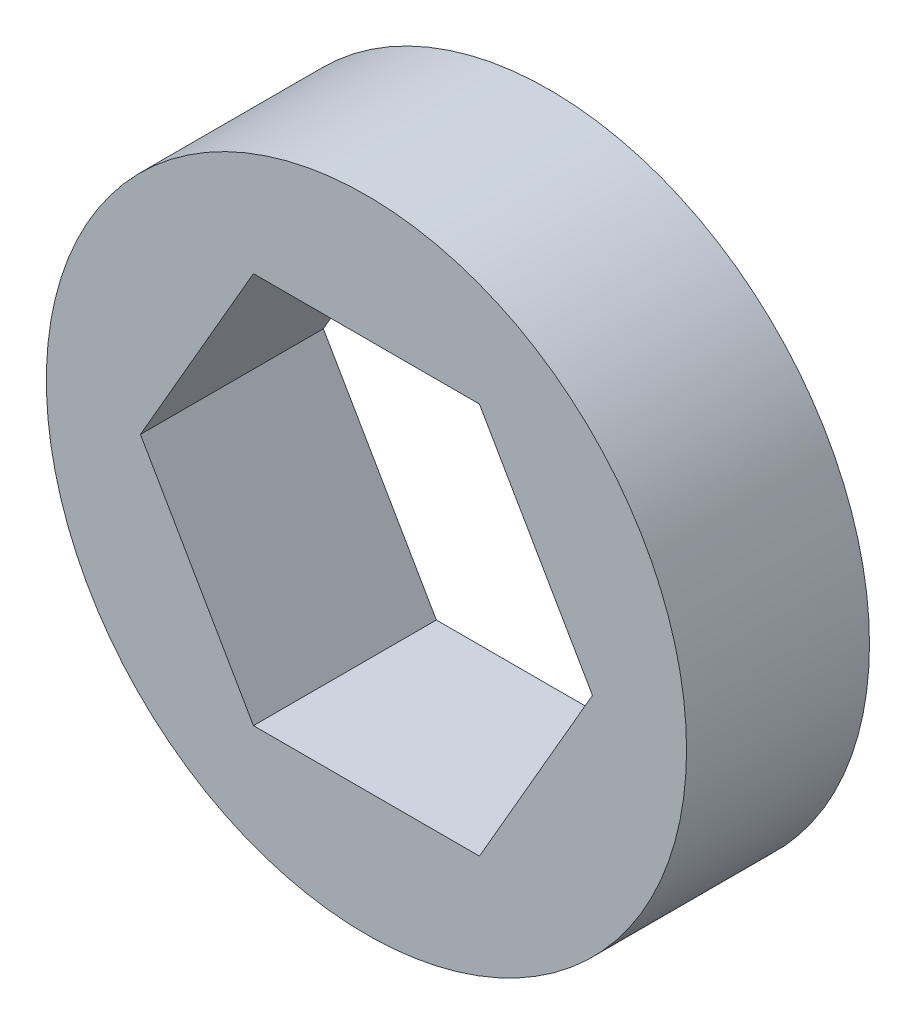
ISO-10303-21;
HEADER;
FILE_DESCRIPTION(('STEP AP214'),'2;1');
FILE_NAME('part.step','',(''),(''),'','','');
FILE_SCHEMA(('AUTOMOTIVE_DESIGN { 1 0 10303 214 1 1 1 1 }'));
ENDSEC;
DATA;
#1=APPLICATION_CONTEXT('core data for automotive mechanical design processes');
#2=APPLICATION_PROTOCOL_DEFINITION('international standard','automotive_design',2000,#1);
#3=PRODUCT_CONTEXT('',#1,'mechanical');
#4=PRODUCT('Part','Part','',(#3));
#5=PRODUCT_RELATED_PRODUCT_CATEGORY('part','',(#4));
#6=PRODUCT_DEFINITION_FORMATION('','',#4);
#7=PRODUCT_DEFINITION_CONTEXT('part definition',#1,'design');
#8=PRODUCT_DEFINITION('design','',#6,#7);
#9=PRODUCT_DEFINITION_SHAPE('','',#8);
#10=(LENGTH_UNIT() NAMED_UNIT(*) SI_UNIT(.MILLI.,.METRE.));
#11=(NAMED_UNIT(*) PLANE_ANGLE_UNIT() SI_UNIT($,.RADIAN.));
#12=(NAMED_UNIT(*) SI_UNIT($,.STERADIAN.) SOLID_ANGLE_UNIT());
#13=UNCERTAINTY_MEASURE_WITH_UNIT(LENGTH_MEASURE(1.E-05),#10,'distance_accuracy_value','');
#14=(GEOMETRIC_REPRESENTATION_CONTEXT(3) GLOBAL_UNCERTAINTY_ASSIGNED_CONTEXT((#13)) GLOBAL_UNIT_ASSIGNED_CONTEXT((#10,
#11,#12)) REPRESENTATION_CONTEXT('',''));
#15=CARTESIAN_POINT('',(0.,0.,0.));
#16=DIRECTION('',(0.,0.,1.));
#17=DIRECTION('',(1.,0.,0.));
#18=AXIS2_PLACEMENT_3D('',#15,#16,#17);
#19=CARTESIAN_POINT('',(0.,0.,6.35));
#20=DIRECTION('',(0.,0.,1.));
#21=DIRECTION('',(1.,0.,0.));
#22=AXIS2_PLACEMENT_3D('',#19,#20,#21);
#23=PLANE('',#22);
#24=CARTESIAN_POINT('',(0.,0.,6.35));
#25=DIRECTION('',(0.,0.,1.));
#26=DIRECTION('',(1.,0.,0.));
#27=AXIS2_PLACEMENT_3D('',#24,#25,#26);
#28=CIRCLE('',#27,11.1125);
#29=CARTESIAN_POINT('',(11.1125,0.,6.35));
#30=VERTEX_POINT('',#29);
#31=EDGE_CURVE('E11',#30,#30,#28,.T.);
#32=ORIENTED_EDGE('',*,*,#31,.T.);
#33=EDGE_LOOP('',(#32));
#34=FACE_BOUND('',#33,.T.);
#35=DIRECTION('',(-0.5,0.866025403784439,0.));
#36=VECTOR('',#35,1.);
#37=CARTESIAN_POINT('',(7.84561280801783,0.,6.35));
#38=LINE('',#37,#36);
#39=CARTESIAN_POINT('',(7.84561280801783,0.,6.35));
#40=VERTEX_POINT('',#39);
#41=CARTESIAN_POINT('',(3.92280640400891,6.79450000000001,6.35));
#42=VERTEX_POINT('',#41);
#43=EDGE_CURVE('E94',#40,#42,#38,.T.);
#44=ORIENTED_EDGE('',*,*,#43,.F.);
#45=DIRECTION('',(0.5,0.866025403784439,0.));
#46=VECTOR('',#45,1.);
#47=CARTESIAN_POINT('',(3.92280640400892,-6.79450000000001,6.35));
#48=LINE('',#47,#46);
#49=CARTESIAN_POINT('',(3.92280640400892,-6.79450000000001,6.35));
#50=VERTEX_POINT('',#49);
#51=EDGE_CURVE('E86',#50,#40,#48,.T.);
#52=ORIENTED_EDGE('',*,*,#51,.F.);
#53=DIRECTION('',(1.,0.,0.));
#54=VECTOR('',#53,1.);
#55=CARTESIAN_POINT('',(-3.92280640400891,-6.79450000000001,6.35));
#56=LINE('',#55,#54);
#57=CARTESIAN_POINT('',(-3.92280640400891,-6.79450000000001,6.35));
#58=VERTEX_POINT('',#57);
#59=EDGE_CURVE('E114',#58,#50,#56,.T.);
#60=ORIENTED_EDGE('',*,*,#59,.F.);
#61=DIRECTION('',(0.5,-0.866025403784438,0.));
#62=VECTOR('',#61,1.);
#63=CARTESIAN_POINT('',(-7.84561280801783,0.,6.35));
#64=LINE('',#63,#62);
#65=CARTESIAN_POINT('',(-7.84561280801783,0.,6.35));
#66=VERTEX_POINT('',#65);
#67=EDGE_CURVE('E112',#66,#58,#64,.T.);
#68=ORIENTED_EDGE('',*,*,#67,.F.);
#69=DIRECTION('',(-0.5,-0.866025403784439,0.));
#70=VECTOR('',#69,1.);
#71=CARTESIAN_POINT('',(-3.92280640400892,6.79450000000001,6.35));
#72=LINE('',#71,#70);
#73=CARTESIAN_POINT('',(-3.92280640400892,6.79450000000001,6.35));
#74=VERTEX_POINT('',#73);
#75=EDGE_CURVE('E108',#74,#66,#72,.T.);
#76=ORIENTED_EDGE('',*,*,#75,.F.);
#77=DIRECTION('',(-1.,0.,0.));
#78=VECTOR('',#77,1.);
#79=CARTESIAN_POINT('',(3.92280640400891,6.79450000000001,6.35));
#80=LINE('',#79,#78);
#81=EDGE_CURVE('E106',#42,#74,#80,.T.);
#82=ORIENTED_EDGE('',*,*,#81,.F.);
#83=EDGE_LOOP('',(#44,#52,#60,#68,#76,#82));
#84=FACE_BOUND('',#83,.T.);
#85=ADVANCED_FACE('F33',(#34,#84),#23,.T.);
#86=CARTESIAN_POINT('',(0.,0.,0.));
#87=DIRECTION('',(0.,0.,1.));
#88=DIRECTION('',(1.,0.,0.));
#89=AXIS2_PLACEMENT_3D('',#86,#87,#88);
#90=PLANE('',#89);
#91=CARTESIAN_POINT('',(0.,0.,0.));
#92=DIRECTION('',(0.,0.,1.));
#93=DIRECTION('',(1.,0.,0.));
#94=AXIS2_PLACEMENT_3D('',#91,#92,#93);
#95=CIRCLE('',#94,11.1125);
#96=CARTESIAN_POINT('',(11.1125,0.,0.));
#97=VERTEX_POINT('',#96);
#98=EDGE_CURVE('E37',#97,#97,#95,.T.);
#99=ORIENTED_EDGE('',*,*,#98,.F.);
#100=EDGE_LOOP('',(#99));
#101=FACE_BOUND('',#100,.T.);
#102=DIRECTION('',(0.5,0.866025403784439,0.));
#103=VECTOR('',#102,1.);
#104=CARTESIAN_POINT('',(3.92280640400892,-6.79450000000001,0.));
#105=LINE('',#104,#103);
#106=CARTESIAN_POINT('',(3.92280640400892,-6.79450000000001,0.));
#107=VERTEX_POINT('',#106);
#108=CARTESIAN_POINT('',(7.84561280801783,0.,0.));
#109=VERTEX_POINT('',#108);
#110=EDGE_CURVE('E56',#107,#109,#105,.T.);
#111=ORIENTED_EDGE('',*,*,#110,.T.);
#112=DIRECTION('',(-0.5,0.866025403784439,0.));
#113=VECTOR('',#112,1.);
#114=CARTESIAN_POINT('',(7.84561280801783,0.,0.));
#115=LINE('',#114,#113);
#116=CARTESIAN_POINT('',(3.92280640400891,6.79450000000001,0.));
#117=VERTEX_POINT('',#116);
#118=EDGE_CURVE('E101',#109,#117,#115,.T.);
#119=ORIENTED_EDGE('',*,*,#118,.T.);
#120=DIRECTION('',(-1.,0.,0.));
#121=VECTOR('',#120,1.);
#122=CARTESIAN_POINT('',(3.92280640400891,6.79450000000001,0.));
#123=LINE('',#122,#121);
#124=CARTESIAN_POINT('',(-3.92280640400892,6.79450000000001,0.));
#125=VERTEX_POINT('',#124);
#126=EDGE_CURVE('E118',#117,#125,#123,.T.);
#127=ORIENTED_EDGE('',*,*,#126,.T.);
#128=DIRECTION('',(-0.5,-0.866025403784439,0.));
#129=VECTOR('',#128,1.);
#130=CARTESIAN_POINT('',(-3.92280640400892,6.79450000000001,0.));
#131=LINE('',#130,#129);
#132=CARTESIAN_POINT('',(-7.84561280801783,0.,0.));
#133=VERTEX_POINT('',#132);
#134=EDGE_CURVE('E121',#125,#133,#131,.T.);
#135=ORIENTED_EDGE('',*,*,#134,.T.);
#136=DIRECTION('',(0.5,-0.866025403784438,0.));
#137=VECTOR('',#136,1.);
#138=CARTESIAN_POINT('',(-7.84561280801783,0.,0.));
#139=LINE('',#138,#137);
#140=CARTESIAN_POINT('',(-3.92280640400891,-6.79450000000001,0.));
#141=VERTEX_POINT('',#140);
#142=EDGE_CURVE('E124',#133,#141,#139,.T.);
#143=ORIENTED_EDGE('',*,*,#142,.T.);
#144=DIRECTION('',(1.,0.,0.));
#145=VECTOR('',#144,1.);
#146=CARTESIAN_POINT('',(-3.92280640400891,-6.79450000000001,0.));
#147=LINE('',#146,#145);
#148=EDGE_CURVE('E95',#141,#107,#147,.T.);
#149=ORIENTED_EDGE('',*,*,#148,.T.);
#150=EDGE_LOOP('',(#111,#119,#127,#135,#143,#149));
#151=FACE_BOUND('',#150,.T.);
#152=ADVANCED_FACE('F141',(#101,#151),#90,.F.);
#153=CARTESIAN_POINT('',(0.,0.,6.35));
#154=DIRECTION('',(0.,0.,-1.));
#155=DIRECTION('',(-1.,0.,0.));
#156=AXIS2_PLACEMENT_3D('',#153,#154,#155);
#157=CYLINDRICAL_SURFACE('',#156,11.1125);
#158=ORIENTED_EDGE('',*,*,#31,.F.);
#159=EDGE_LOOP('',(#158));
#160=FACE_BOUND('',#159,.T.);
#161=ORIENTED_EDGE('',*,*,#98,.T.);
#162=EDGE_LOOP('',(#161));
#163=FACE_BOUND('',#162,.T.);
#164=ADVANCED_FACE('F35',(#160,#163),#157,.T.);
#165=CARTESIAN_POINT('',(3.92280640400892,-6.79450000000001,6.35));
#166=DIRECTION('',(-0.866025403784439,0.5,0.));
#167=DIRECTION('',(-0.5,-0.866025403784439,0.));
#168=AXIS2_PLACEMENT_3D('',#165,#166,#167);
#169=PLANE('',#168);
#170=ORIENTED_EDGE('',*,*,#110,.F.);
#171=DIRECTION('',(0.,0.,-1.));
#172=VECTOR('',#171,1.);
#173=CARTESIAN_POINT('',(3.92280640400892,-6.79450000000001,6.35));
#174=LINE('',#173,#172);
#175=EDGE_CURVE('E90',#50,#107,#174,.T.);
#176=ORIENTED_EDGE('',*,*,#175,.F.);
#177=ORIENTED_EDGE('',*,*,#51,.T.);
#178=DIRECTION('',(0.,0.,-1.));
#179=VECTOR('',#178,1.);
#180=CARTESIAN_POINT('',(7.84561280801783,0.,6.35));
#181=LINE('',#180,#179);
#182=EDGE_CURVE('E89',#40,#109,#181,.T.);
#183=ORIENTED_EDGE('',*,*,#182,.T.);
#184=EDGE_LOOP('',(#170,#176,#177,#183));
#185=FACE_BOUND('',#184,.T.);
#186=ADVANCED_FACE('F88',(#185),#169,.T.);
#187=CARTESIAN_POINT('',(7.84561280801783,0.,6.35));
#188=DIRECTION('',(-0.866025403784439,-0.5,0.));
#189=DIRECTION('',(0.5,-0.866025403784439,0.));
#190=AXIS2_PLACEMENT_3D('',#187,#188,#189);
#191=PLANE('',#190);
#192=ORIENTED_EDGE('',*,*,#118,.F.);
#193=ORIENTED_EDGE('',*,*,#182,.F.);
#194=ORIENTED_EDGE('',*,*,#43,.T.);
#195=DIRECTION('',(0.,0.,-1.));
#196=VECTOR('',#195,1.);
#197=CARTESIAN_POINT('',(3.92280640400891,6.79450000000001,6.35));
#198=LINE('',#197,#196);
#199=EDGE_CURVE('E102',#42,#117,#198,.T.);
#200=ORIENTED_EDGE('',*,*,#199,.T.);
#201=EDGE_LOOP('',(#192,#193,#194,#200));
#202=FACE_BOUND('',#201,.T.);
#203=ADVANCED_FACE('F98',(#202),#191,.T.);
#204=CARTESIAN_POINT('',(3.92280640400891,6.79450000000001,6.35));
#205=DIRECTION('',(0.,-1.,0.));
#206=DIRECTION('',(1.,0.,0.));
#207=AXIS2_PLACEMENT_3D('',#204,#205,#206);
#208=PLANE('',#207);
#209=ORIENTED_EDGE('',*,*,#126,.F.);
#210=ORIENTED_EDGE('',*,*,#199,.F.);
#211=ORIENTED_EDGE('',*,*,#81,.T.);
#212=DIRECTION('',(0.,0.,-1.));
#213=VECTOR('',#212,1.);
#214=CARTESIAN_POINT('',(-3.92280640400892,6.79450000000001,6.35));
#215=LINE('',#214,#213);
#216=EDGE_CURVE('E133',#74,#125,#215,.T.);
#217=ORIENTED_EDGE('',*,*,#216,.T.);
#218=EDGE_LOOP('',(#209,#210,#211,#217));
#219=FACE_BOUND('',#218,.T.);
#220=ADVANCED_FACE('F137',(#219),#208,.T.);
#221=CARTESIAN_POINT('',(-3.92280640400892,6.79450000000001,6.35));
#222=DIRECTION('',(0.866025403784439,-0.5,0.));
#223=DIRECTION('',(0.5,0.866025403784439,0.));
#224=AXIS2_PLACEMENT_3D('',#221,#222,#223);
#225=PLANE('',#224);
#226=ORIENTED_EDGE('',*,*,#134,.F.);
#227=ORIENTED_EDGE('',*,*,#216,.F.);
#228=ORIENTED_EDGE('',*,*,#75,.T.);
#229=DIRECTION('',(0.,0.,-1.));
#230=VECTOR('',#229,1.);
#231=CARTESIAN_POINT('',(-7.84561280801783,0.,6.35));
#232=LINE('',#231,#230);
#233=EDGE_CURVE('E131',#66,#133,#232,.T.);
#234=ORIENTED_EDGE('',*,*,#233,.T.);
#235=EDGE_LOOP('',(#226,#227,#228,#234));
#236=FACE_BOUND('',#235,.T.);
#237=ADVANCED_FACE('F149',(#236),#225,.T.);
#238=CARTESIAN_POINT('',(-7.84561280801783,0.,6.35));
#239=DIRECTION('',(0.866025403784439,0.5,0.));
#240=DIRECTION('',(-0.5,0.866025403784439,0.));
#241=AXIS2_PLACEMENT_3D('',#238,#239,#240);
#242=PLANE('',#241);
#243=ORIENTED_EDGE('',*,*,#142,.F.);
#244=ORIENTED_EDGE('',*,*,#233,.F.);
#245=ORIENTED_EDGE('',*,*,#67,.T.);
#246=DIRECTION('',(0.,0.,-1.));
#247=VECTOR('',#246,1.);
#248=CARTESIAN_POINT('',(-3.92280640400891,-6.79450000000001,6.35));
#249=LINE('',#248,#247);
#250=EDGE_CURVE('E48',#58,#141,#249,.T.);
#251=ORIENTED_EDGE('',*,*,#250,.T.);
#252=EDGE_LOOP('',(#243,#244,#245,#251));
#253=FACE_BOUND('',#252,.T.);
#254=ADVANCED_FACE('F147',(#253),#242,.T.);
#255=CARTESIAN_POINT('',(-3.92280640400891,-6.79450000000001,6.35));
#256=DIRECTION('',(0.,1.,0.));
#257=DIRECTION('',(0.,0.,1.));
#258=AXIS2_PLACEMENT_3D('',#255,#256,#257);
#259=PLANE('',#258);
#260=ORIENTED_EDGE('',*,*,#148,.F.);
#261=ORIENTED_EDGE('',*,*,#250,.F.);
#262=ORIENTED_EDGE('',*,*,#59,.T.);
#263=ORIENTED_EDGE('',*,*,#175,.T.);
#264=EDGE_LOOP('',(#260,#261,#262,#263));
#265=FACE_BOUND('',#264,.T.);
#266=ADVANCED_FACE('F143',(#265),#259,.T.);
#267=CLOSED_SHELL('',(#85,#152,#164,#186,#203,#220,#237,#254,#266));
#268=MANIFOLD_SOLID_BREP('B2',#267);
#269=ADVANCED_BREP_SHAPE_REPRESENTATION('',(#18,#268),#14);
#270=SHAPE_DEFINITION_REPRESENTATION(#9,#269);
ENDSEC;
END-ISO-10303-21;
